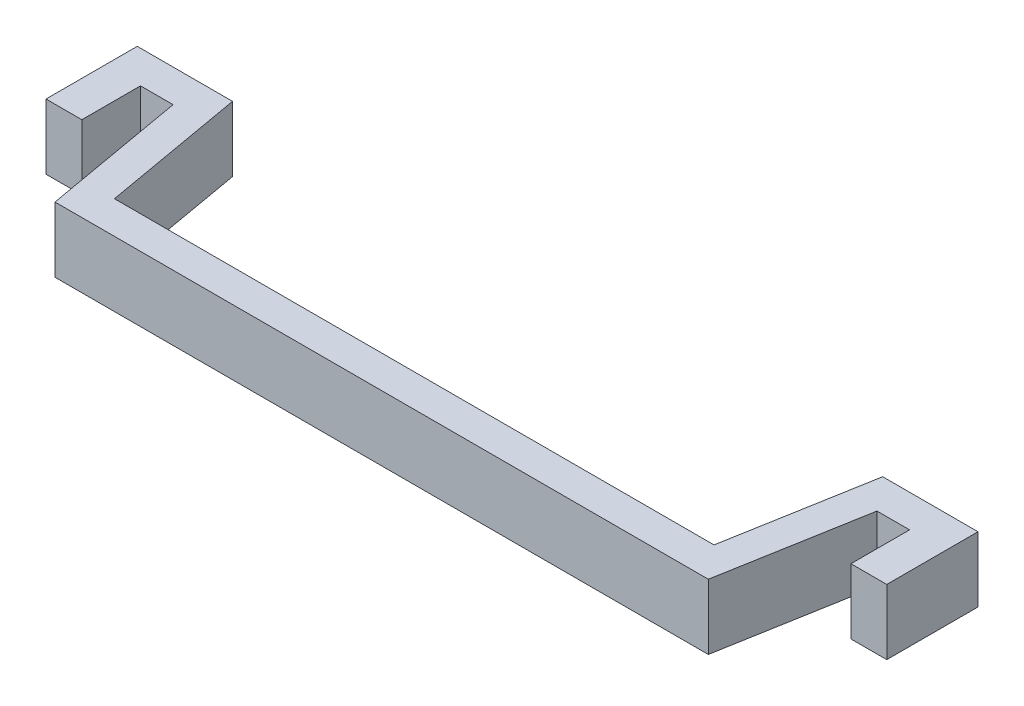
ISO-10303-21;
HEADER;
FILE_DESCRIPTION(('STEP AP214'),'2;1');
FILE_NAME('part.step','',(''),(''),'','','');
FILE_SCHEMA(('AUTOMOTIVE_DESIGN { 1 0 10303 214 1 1 1 1 }'));
ENDSEC;
DATA;
#1=APPLICATION_CONTEXT('core data for automotive mechanical design processes');
#2=APPLICATION_PROTOCOL_DEFINITION('international standard','automotive_design',2000,#1);
#3=PRODUCT_CONTEXT('',#1,'mechanical');
#4=PRODUCT('Part','Part','',(#3));
#5=PRODUCT_RELATED_PRODUCT_CATEGORY('part','',(#4));
#6=PRODUCT_DEFINITION_FORMATION('','',#4);
#7=PRODUCT_DEFINITION_CONTEXT('part definition',#1,'design');
#8=PRODUCT_DEFINITION('design','',#6,#7);
#9=PRODUCT_DEFINITION_SHAPE('','',#8);
#10=(LENGTH_UNIT() NAMED_UNIT(*) SI_UNIT(.MILLI.,.METRE.));
#11=(NAMED_UNIT(*) PLANE_ANGLE_UNIT() SI_UNIT($,.RADIAN.));
#12=(NAMED_UNIT(*) SI_UNIT($,.STERADIAN.) SOLID_ANGLE_UNIT());
#13=UNCERTAINTY_MEASURE_WITH_UNIT(LENGTH_MEASURE(1.E-05),#10,'distance_accuracy_value','');
#14=(GEOMETRIC_REPRESENTATION_CONTEXT(3) GLOBAL_UNCERTAINTY_ASSIGNED_CONTEXT((#13)) GLOBAL_UNIT_ASSIGNED_CONTEXT((#10,
#11,#12)) REPRESENTATION_CONTEXT('',''));
#15=CARTESIAN_POINT('',(0.,0.,0.));
#16=DIRECTION('',(0.,0.,1.));
#17=DIRECTION('',(1.,0.,0.));
#18=AXIS2_PLACEMENT_3D('',#15,#16,#17);
#19=CARTESIAN_POINT('',(-12.7306848318011,2.54,0.));
#20=DIRECTION('',(0.984807753012209,0.,-0.173648177666927));
#21=DIRECTION('',(-0.173648177666927,0.,-0.984807753012209));
#22=AXIS2_PLACEMENT_3D('',#19,#20,#21);
#23=PLANE('',#22);
#24=DIRECTION('',(0.173648177666927,0.,0.984807753012209));
#25=VECTOR('',#24,1.);
#26=CARTESIAN_POINT('',(-12.7306848318011,0.,0.));
#27=LINE('',#26,#25);
#28=CARTESIAN_POINT('',(-13.716,0.,-5.588));
#29=VERTEX_POINT('',#28);
#30=CARTESIAN_POINT('',(-12.7306848318011,0.,0.));
#31=VERTEX_POINT('',#30);
#32=EDGE_CURVE('E177',#29,#31,#27,.T.);
#33=ORIENTED_EDGE('',*,*,#32,.T.);
#34=DIRECTION('',(0.,-1.,0.));
#35=VECTOR('',#34,1.);
#36=CARTESIAN_POINT('',(-12.7306848318011,2.54,0.));
#37=LINE('',#36,#35);
#38=CARTESIAN_POINT('',(-12.7306848318011,2.54,0.));
#39=VERTEX_POINT('',#38);
#40=EDGE_CURVE('E11',#39,#31,#37,.T.);
#41=ORIENTED_EDGE('',*,*,#40,.F.);
#42=DIRECTION('',(0.173648177666927,0.,0.984807753012209));
#43=VECTOR('',#42,1.);
#44=CARTESIAN_POINT('',(-12.7306848318011,2.54,0.));
#45=LINE('',#44,#43);
#46=CARTESIAN_POINT('',(-13.716,2.54,-5.588));
#47=VERTEX_POINT('',#46);
#48=EDGE_CURVE('E207',#47,#39,#45,.T.);
#49=ORIENTED_EDGE('',*,*,#48,.F.);
#50=DIRECTION('',(0.,-1.,0.));
#51=VECTOR('',#50,1.);
#52=CARTESIAN_POINT('',(-13.716,2.54,-5.588));
#53=LINE('',#52,#51);
#54=EDGE_CURVE('E173',#47,#29,#53,.T.);
#55=ORIENTED_EDGE('',*,*,#54,.T.);
#56=EDGE_LOOP('',(#33,#41,#49,#55));
#57=FACE_BOUND('',#56,.T.);
#58=ADVANCED_FACE('F33',(#57),#23,.F.);
#59=CARTESIAN_POINT('',(12.7306848318011,2.54,0.));
#60=DIRECTION('',(0.,0.,-1.));
#61=DIRECTION('',(-1.,0.,0.));
#62=AXIS2_PLACEMENT_3D('',#59,#60,#61);
#63=PLANE('',#62);
#64=DIRECTION('',(1.,0.,0.));
#65=VECTOR('',#64,1.);
#66=CARTESIAN_POINT('',(12.7306848318011,0.,0.));
#67=LINE('',#66,#65);
#68=CARTESIAN_POINT('',(12.7306848318011,0.,0.));
#69=VERTEX_POINT('',#68);
#70=EDGE_CURVE('E180',#31,#69,#67,.T.);
#71=ORIENTED_EDGE('',*,*,#70,.T.);
#72=DIRECTION('',(0.,-1.,0.));
#73=VECTOR('',#72,1.);
#74=CARTESIAN_POINT('',(12.7306848318011,2.54,0.));
#75=LINE('',#74,#73);
#76=CARTESIAN_POINT('',(12.7306848318011,2.54,0.));
#77=VERTEX_POINT('',#76);
#78=EDGE_CURVE('E41',#77,#69,#75,.T.);
#79=ORIENTED_EDGE('',*,*,#78,.F.);
#80=DIRECTION('',(1.,0.,0.));
#81=VECTOR('',#80,1.);
#82=CARTESIAN_POINT('',(12.7306848318011,2.54,0.));
#83=LINE('',#82,#81);
#84=EDGE_CURVE('E116',#39,#77,#83,.T.);
#85=ORIENTED_EDGE('',*,*,#84,.F.);
#86=ORIENTED_EDGE('',*,*,#40,.T.);
#87=EDGE_LOOP('',(#71,#79,#85,#86));
#88=FACE_BOUND('',#87,.T.);
#89=ADVANCED_FACE('F305',(#88),#63,.F.);
#90=CARTESIAN_POINT('',(12.7306848318011,2.54,0.));
#91=DIRECTION('',(-0.984807753012209,0.,-0.173648177666927));
#92=DIRECTION('',(-0.173648177666927,0.,0.984807753012209));
#93=AXIS2_PLACEMENT_3D('',#90,#91,#92);
#94=PLANE('',#93);
#95=DIRECTION('',(0.173648177666927,0.,-0.984807753012209));
#96=VECTOR('',#95,1.);
#97=CARTESIAN_POINT('',(12.7306848318011,0.,0.));
#98=LINE('',#97,#96);
#99=CARTESIAN_POINT('',(13.716,0.,-5.588));
#100=VERTEX_POINT('',#99);
#101=EDGE_CURVE('E182',#69,#100,#98,.T.);
#102=ORIENTED_EDGE('',*,*,#101,.T.);
#103=DIRECTION('',(0.,-1.,0.));
#104=VECTOR('',#103,1.);
#105=CARTESIAN_POINT('',(13.716,2.54,-5.588));
#106=LINE('',#105,#104);
#107=CARTESIAN_POINT('',(13.716,2.54,-5.588));
#108=VERTEX_POINT('',#107);
#109=EDGE_CURVE('E238',#108,#100,#106,.T.);
#110=ORIENTED_EDGE('',*,*,#109,.F.);
#111=DIRECTION('',(0.173648177666927,0.,-0.984807753012209));
#112=VECTOR('',#111,1.);
#113=CARTESIAN_POINT('',(12.7306848318011,2.54,0.));
#114=LINE('',#113,#112);
#115=EDGE_CURVE('E246',#77,#108,#114,.T.);
#116=ORIENTED_EDGE('',*,*,#115,.F.);
#117=ORIENTED_EDGE('',*,*,#78,.T.);
#118=EDGE_LOOP('',(#102,#110,#116,#117));
#119=FACE_BOUND('',#118,.T.);
#120=ADVANCED_FACE('F244',(#119),#94,.F.);
#121=CARTESIAN_POINT('',(13.716,2.54,-5.588));
#122=DIRECTION('',(0.,0.,-1.));
#123=DIRECTION('',(-1.,0.,0.));
#124=AXIS2_PLACEMENT_3D('',#121,#122,#123);
#125=PLANE('',#124);
#126=DIRECTION('',(1.,0.,0.));
#127=VECTOR('',#126,1.);
#128=CARTESIAN_POINT('',(13.716,0.,-5.588));
#129=LINE('',#128,#127);
#130=CARTESIAN_POINT('',(14.986,0.,-5.588));
#131=VERTEX_POINT('',#130);
#132=EDGE_CURVE('E184',#100,#131,#129,.T.);
#133=ORIENTED_EDGE('',*,*,#132,.T.);
#134=DIRECTION('',(0.,-1.,0.));
#135=VECTOR('',#134,1.);
#136=CARTESIAN_POINT('',(14.986,2.54,-5.588));
#137=LINE('',#136,#135);
#138=CARTESIAN_POINT('',(14.986,2.54,-5.588));
#139=VERTEX_POINT('',#138);
#140=EDGE_CURVE('E235',#139,#131,#137,.T.);
#141=ORIENTED_EDGE('',*,*,#140,.F.);
#142=DIRECTION('',(1.,0.,0.));
#143=VECTOR('',#142,1.);
#144=CARTESIAN_POINT('',(13.716,2.54,-5.588));
#145=LINE('',#144,#143);
#146=EDGE_CURVE('E264',#108,#139,#145,.T.);
#147=ORIENTED_EDGE('',*,*,#146,.F.);
#148=ORIENTED_EDGE('',*,*,#109,.T.);
#149=EDGE_LOOP('',(#133,#141,#147,#148));
#150=FACE_BOUND('',#149,.T.);
#151=ADVANCED_FACE('F255',(#150),#125,.F.);
#152=CARTESIAN_POINT('',(14.986,2.54,-5.588));
#153=DIRECTION('',(1.,0.,0.));
#154=DIRECTION('',(0.,0.,-1.));
#155=AXIS2_PLACEMENT_3D('',#152,#153,#154);
#156=PLANE('',#155);
#157=DIRECTION('',(0.,0.,1.));
#158=VECTOR('',#157,1.);
#159=CARTESIAN_POINT('',(14.986,0.,-5.588));
#160=LINE('',#159,#158);
#161=CARTESIAN_POINT('',(14.986,0.,-3.302));
#162=VERTEX_POINT('',#161);
#163=EDGE_CURVE('E186',#131,#162,#160,.T.);
#164=ORIENTED_EDGE('',*,*,#163,.T.);
#165=DIRECTION('',(0.,-1.,0.));
#166=VECTOR('',#165,1.);
#167=CARTESIAN_POINT('',(14.986,2.54,-3.302));
#168=LINE('',#167,#166);
#169=CARTESIAN_POINT('',(14.986,2.54,-3.302));
#170=VERTEX_POINT('',#169);
#171=EDGE_CURVE('E232',#170,#162,#168,.T.);
#172=ORIENTED_EDGE('',*,*,#171,.F.);
#173=DIRECTION('',(0.,0.,1.));
#174=VECTOR('',#173,1.);
#175=CARTESIAN_POINT('',(14.986,2.54,-5.588));
#176=LINE('',#175,#174);
#177=EDGE_CURVE('E261',#139,#170,#176,.T.);
#178=ORIENTED_EDGE('',*,*,#177,.F.);
#179=ORIENTED_EDGE('',*,*,#140,.T.);
#180=EDGE_LOOP('',(#164,#172,#178,#179));
#181=FACE_BOUND('',#180,.T.);
#182=ADVANCED_FACE('F259',(#181),#156,.F.);
#183=CARTESIAN_POINT('',(14.986,2.54,-3.302));
#184=DIRECTION('',(0.,0.,-1.));
#185=DIRECTION('',(-1.,0.,0.));
#186=AXIS2_PLACEMENT_3D('',#183,#184,#185);
#187=PLANE('',#186);
#188=DIRECTION('',(1.,0.,0.));
#189=VECTOR('',#188,1.);
#190=CARTESIAN_POINT('',(14.986,0.,-3.302));
#191=LINE('',#190,#189);
#192=CARTESIAN_POINT('',(16.383,0.,-3.302));
#193=VERTEX_POINT('',#192);
#194=EDGE_CURVE('E188',#162,#193,#191,.T.);
#195=ORIENTED_EDGE('',*,*,#194,.T.);
#196=DIRECTION('',(0.,-1.,0.));
#197=VECTOR('',#196,1.);
#198=CARTESIAN_POINT('',(16.383,2.54,-3.302));
#199=LINE('',#198,#197);
#200=CARTESIAN_POINT('',(16.383,2.54,-3.302));
#201=VERTEX_POINT('',#200);
#202=EDGE_CURVE('E229',#201,#193,#199,.T.);
#203=ORIENTED_EDGE('',*,*,#202,.F.);
#204=DIRECTION('',(1.,0.,0.));
#205=VECTOR('',#204,1.);
#206=CARTESIAN_POINT('',(14.986,2.54,-3.302));
#207=LINE('',#206,#205);
#208=EDGE_CURVE('E263',#170,#201,#207,.T.);
#209=ORIENTED_EDGE('',*,*,#208,.F.);
#210=ORIENTED_EDGE('',*,*,#171,.T.);
#211=EDGE_LOOP('',(#195,#203,#209,#210));
#212=FACE_BOUND('',#211,.T.);
#213=ADVANCED_FACE('F318',(#212),#187,.F.);
#214=CARTESIAN_POINT('',(16.383,2.54,-3.302));
#215=DIRECTION('',(-1.,0.,0.));
#216=DIRECTION('',(0.,0.,1.));
#217=AXIS2_PLACEMENT_3D('',#214,#215,#216);
#218=PLANE('',#217);
#219=DIRECTION('',(0.,0.,-1.));
#220=VECTOR('',#219,1.);
#221=CARTESIAN_POINT('',(16.383,0.,-3.302));
#222=LINE('',#221,#220);
#223=CARTESIAN_POINT('',(16.383,0.,-6.858));
#224=VERTEX_POINT('',#223);
#225=EDGE_CURVE('E190',#193,#224,#222,.T.);
#226=ORIENTED_EDGE('',*,*,#225,.T.);
#227=DIRECTION('',(0.,-1.,0.));
#228=VECTOR('',#227,1.);
#229=CARTESIAN_POINT('',(16.383,2.54,-6.858));
#230=LINE('',#229,#228);
#231=CARTESIAN_POINT('',(16.383,2.54,-6.858));
#232=VERTEX_POINT('',#231);
#233=EDGE_CURVE('E226',#232,#224,#230,.T.);
#234=ORIENTED_EDGE('',*,*,#233,.F.);
#235=DIRECTION('',(0.,0.,-1.));
#236=VECTOR('',#235,1.);
#237=CARTESIAN_POINT('',(16.383,2.54,-3.302));
#238=LINE('',#237,#236);
#239=EDGE_CURVE('E266',#201,#232,#238,.T.);
#240=ORIENTED_EDGE('',*,*,#239,.F.);
#241=ORIENTED_EDGE('',*,*,#202,.T.);
#242=EDGE_LOOP('',(#226,#234,#240,#241));
#243=FACE_BOUND('',#242,.T.);
#244=ADVANCED_FACE('F321',(#243),#218,.F.);
#245=CARTESIAN_POINT('',(16.383,2.54,-6.858));
#246=DIRECTION('',(0.,0.,1.));
#247=DIRECTION('',(1.,0.,0.));
#248=AXIS2_PLACEMENT_3D('',#245,#246,#247);
#249=PLANE('',#248);
#250=DIRECTION('',(-1.,0.,0.));
#251=VECTOR('',#250,1.);
#252=CARTESIAN_POINT('',(16.383,0.,-6.858));
#253=LINE('',#252,#251);
#254=CARTESIAN_POINT('',(12.6693151681989,0.,-6.858));
#255=VERTEX_POINT('',#254);
#256=EDGE_CURVE('E192',#224,#255,#253,.T.);
#257=ORIENTED_EDGE('',*,*,#256,.T.);
#258=DIRECTION('',(0.,-1.,0.));
#259=VECTOR('',#258,1.);
#260=CARTESIAN_POINT('',(12.6693151681989,2.54,-6.858));
#261=LINE('',#260,#259);
#262=CARTESIAN_POINT('',(12.6693151681989,2.54,-6.858));
#263=VERTEX_POINT('',#262);
#264=EDGE_CURVE('E223',#263,#255,#261,.T.);
#265=ORIENTED_EDGE('',*,*,#264,.F.);
#266=DIRECTION('',(-1.,0.,0.));
#267=VECTOR('',#266,1.);
#268=CARTESIAN_POINT('',(16.383,2.54,-6.858));
#269=LINE('',#268,#267);
#270=EDGE_CURVE('E272',#232,#263,#269,.T.);
#271=ORIENTED_EDGE('',*,*,#270,.F.);
#272=ORIENTED_EDGE('',*,*,#233,.T.);
#273=EDGE_LOOP('',(#257,#265,#271,#272));
#274=FACE_BOUND('',#273,.T.);
#275=ADVANCED_FACE('F325',(#274),#249,.F.);
#276=CARTESIAN_POINT('',(12.6693151681989,2.54,-6.858));
#277=DIRECTION('',(0.984807753012209,0.,0.173648177666927));
#278=DIRECTION('',(0.173648177666927,0.,-0.984807753012209));
#279=AXIS2_PLACEMENT_3D('',#276,#277,#278);
#280=PLANE('',#279);
#281=DIRECTION('',(-0.173648177666927,0.,0.984807753012209));
#282=VECTOR('',#281,1.);
#283=CARTESIAN_POINT('',(12.6693151681989,0.,-6.858));
#284=LINE('',#283,#282);
#285=CARTESIAN_POINT('',(11.684,0.,-1.27));
#286=VERTEX_POINT('',#285);
#287=EDGE_CURVE('E194',#255,#286,#284,.T.);
#288=ORIENTED_EDGE('',*,*,#287,.T.);
#289=DIRECTION('',(0.,-1.,0.));
#290=VECTOR('',#289,1.);
#291=CARTESIAN_POINT('',(11.684,2.54,-1.27));
#292=LINE('',#291,#290);
#293=CARTESIAN_POINT('',(11.684,2.54,-1.27));
#294=VERTEX_POINT('',#293);
#295=EDGE_CURVE('E220',#294,#286,#292,.T.);
#296=ORIENTED_EDGE('',*,*,#295,.F.);
#297=DIRECTION('',(-0.173648177666927,0.,0.984807753012209));
#298=VECTOR('',#297,1.);
#299=CARTESIAN_POINT('',(12.6693151681989,2.54,-6.858));
#300=LINE('',#299,#298);
#301=EDGE_CURVE('E274',#263,#294,#300,.T.);
#302=ORIENTED_EDGE('',*,*,#301,.F.);
#303=ORIENTED_EDGE('',*,*,#264,.T.);
#304=EDGE_LOOP('',(#288,#296,#302,#303));
#305=FACE_BOUND('',#304,.T.);
#306=ADVANCED_FACE('F329',(#305),#280,.F.);
#307=CARTESIAN_POINT('',(-11.684,2.54,-1.27));
#308=DIRECTION('',(0.,0.,1.));
#309=DIRECTION('',(1.,0.,0.));
#310=AXIS2_PLACEMENT_3D('',#307,#308,#309);
#311=PLANE('',#310);
#312=DIRECTION('',(-1.,0.,0.));
#313=VECTOR('',#312,1.);
#314=CARTESIAN_POINT('',(-11.684,0.,-1.27));
#315=LINE('',#314,#313);
#316=CARTESIAN_POINT('',(-11.684,0.,-1.27));
#317=VERTEX_POINT('',#316);
#318=EDGE_CURVE('E196',#286,#317,#315,.T.);
#319=ORIENTED_EDGE('',*,*,#318,.T.);
#320=DIRECTION('',(0.,-1.,0.));
#321=VECTOR('',#320,1.);
#322=CARTESIAN_POINT('',(-11.684,2.54,-1.27));
#323=LINE('',#322,#321);
#324=CARTESIAN_POINT('',(-11.684,2.54,-1.27));
#325=VERTEX_POINT('',#324);
#326=EDGE_CURVE('E217',#325,#317,#323,.T.);
#327=ORIENTED_EDGE('',*,*,#326,.F.);
#328=DIRECTION('',(-1.,0.,0.));
#329=VECTOR('',#328,1.);
#330=CARTESIAN_POINT('',(-11.684,2.54,-1.27));
#331=LINE('',#330,#329);
#332=EDGE_CURVE('E276',#294,#325,#331,.T.);
#333=ORIENTED_EDGE('',*,*,#332,.F.);
#334=ORIENTED_EDGE('',*,*,#295,.T.);
#335=EDGE_LOOP('',(#319,#327,#333,#334));
#336=FACE_BOUND('',#335,.T.);
#337=ADVANCED_FACE('F333',(#336),#311,.F.);
#338=CARTESIAN_POINT('',(-12.6693151681989,2.54,-6.858));
#339=DIRECTION('',(-0.984807753012209,0.,0.173648177666927));
#340=DIRECTION('',(0.173648177666927,0.,0.984807753012209));
#341=AXIS2_PLACEMENT_3D('',#338,#339,#340);
#342=PLANE('',#341);
#343=DIRECTION('',(-0.173648177666927,0.,-0.984807753012209));
#344=VECTOR('',#343,1.);
#345=CARTESIAN_POINT('',(-12.6693151681989,0.,-6.858));
#346=LINE('',#345,#344);
#347=CARTESIAN_POINT('',(-12.6693151681989,0.,-6.858));
#348=VERTEX_POINT('',#347);
#349=EDGE_CURVE('E198',#317,#348,#346,.T.);
#350=ORIENTED_EDGE('',*,*,#349,.T.);
#351=DIRECTION('',(0.,-1.,0.));
#352=VECTOR('',#351,1.);
#353=CARTESIAN_POINT('',(-12.6693151681989,2.54,-6.858));
#354=LINE('',#353,#352);
#355=CARTESIAN_POINT('',(-12.6693151681989,2.54,-6.858));
#356=VERTEX_POINT('',#355);
#357=EDGE_CURVE('E214',#356,#348,#354,.T.);
#358=ORIENTED_EDGE('',*,*,#357,.F.);
#359=DIRECTION('',(-0.173648177666927,0.,-0.984807753012209));
#360=VECTOR('',#359,1.);
#361=CARTESIAN_POINT('',(-12.6693151681989,2.54,-6.858));
#362=LINE('',#361,#360);
#363=EDGE_CURVE('E278',#325,#356,#362,.T.);
#364=ORIENTED_EDGE('',*,*,#363,.F.);
#365=ORIENTED_EDGE('',*,*,#326,.T.);
#366=EDGE_LOOP('',(#350,#358,#364,#365));
#367=FACE_BOUND('',#366,.T.);
#368=ADVANCED_FACE('F337',(#367),#342,.F.);
#369=CARTESIAN_POINT('',(-16.383,2.54,-6.858));
#370=DIRECTION('',(0.,0.,1.));
#371=DIRECTION('',(1.,0.,0.));
#372=AXIS2_PLACEMENT_3D('',#369,#370,#371);
#373=PLANE('',#372);
#374=DIRECTION('',(-1.,0.,0.));
#375=VECTOR('',#374,1.);
#376=CARTESIAN_POINT('',(-16.383,0.,-6.858));
#377=LINE('',#376,#375);
#378=CARTESIAN_POINT('',(-16.383,0.,-6.858));
#379=VERTEX_POINT('',#378);
#380=EDGE_CURVE('E200',#348,#379,#377,.T.);
#381=ORIENTED_EDGE('',*,*,#380,.T.);
#382=DIRECTION('',(0.,-1.,0.));
#383=VECTOR('',#382,1.);
#384=CARTESIAN_POINT('',(-16.383,2.54,-6.858));
#385=LINE('',#384,#383);
#386=CARTESIAN_POINT('',(-16.383,2.54,-6.858));
#387=VERTEX_POINT('',#386);
#388=EDGE_CURVE('E211',#387,#379,#385,.T.);
#389=ORIENTED_EDGE('',*,*,#388,.F.);
#390=DIRECTION('',(-1.,0.,0.));
#391=VECTOR('',#390,1.);
#392=CARTESIAN_POINT('',(-16.383,2.54,-6.858));
#393=LINE('',#392,#391);
#394=EDGE_CURVE('E280',#356,#387,#393,.T.);
#395=ORIENTED_EDGE('',*,*,#394,.F.);
#396=ORIENTED_EDGE('',*,*,#357,.T.);
#397=EDGE_LOOP('',(#381,#389,#395,#396));
#398=FACE_BOUND('',#397,.T.);
#399=ADVANCED_FACE('F286',(#398),#373,.F.);
#400=CARTESIAN_POINT('',(-16.383,2.54,-3.302));
#401=DIRECTION('',(1.,0.,0.));
#402=DIRECTION('',(0.,0.,-1.));
#403=AXIS2_PLACEMENT_3D('',#400,#401,#402);
#404=PLANE('',#403);
#405=DIRECTION('',(0.,0.,1.));
#406=VECTOR('',#405,1.);
#407=CARTESIAN_POINT('',(-16.383,0.,-3.302));
#408=LINE('',#407,#406);
#409=CARTESIAN_POINT('',(-16.383,0.,-3.302));
#410=VERTEX_POINT('',#409);
#411=EDGE_CURVE('E202',#379,#410,#408,.T.);
#412=ORIENTED_EDGE('',*,*,#411,.T.);
#413=DIRECTION('',(0.,-1.,0.));
#414=VECTOR('',#413,1.);
#415=CARTESIAN_POINT('',(-16.383,2.54,-3.302));
#416=LINE('',#415,#414);
#417=CARTESIAN_POINT('',(-16.383,2.54,-3.302));
#418=VERTEX_POINT('',#417);
#419=EDGE_CURVE('E168',#418,#410,#416,.T.);
#420=ORIENTED_EDGE('',*,*,#419,.F.);
#421=DIRECTION('',(0.,0.,1.));
#422=VECTOR('',#421,1.);
#423=CARTESIAN_POINT('',(-16.383,2.54,-3.302));
#424=LINE('',#423,#422);
#425=EDGE_CURVE('E159',#387,#418,#424,.T.);
#426=ORIENTED_EDGE('',*,*,#425,.F.);
#427=ORIENTED_EDGE('',*,*,#388,.T.);
#428=EDGE_LOOP('',(#412,#420,#426,#427));
#429=FACE_BOUND('',#428,.T.);
#430=ADVANCED_FACE('F290',(#429),#404,.F.);
#431=CARTESIAN_POINT('',(-14.986,2.54,-3.302));
#432=DIRECTION('',(0.,0.,-1.));
#433=DIRECTION('',(-1.,0.,0.));
#434=AXIS2_PLACEMENT_3D('',#431,#432,#433);
#435=PLANE('',#434);
#436=DIRECTION('',(1.,0.,0.));
#437=VECTOR('',#436,1.);
#438=CARTESIAN_POINT('',(-14.986,0.,-3.302));
#439=LINE('',#438,#437);
#440=CARTESIAN_POINT('',(-14.986,0.,-3.302));
#441=VERTEX_POINT('',#440);
#442=EDGE_CURVE('E167',#410,#441,#439,.T.);
#443=ORIENTED_EDGE('',*,*,#442,.T.);
#444=DIRECTION('',(0.,-1.,0.));
#445=VECTOR('',#444,1.);
#446=CARTESIAN_POINT('',(-14.986,2.54,-3.302));
#447=LINE('',#446,#445);
#448=CARTESIAN_POINT('',(-14.986,2.54,-3.302));
#449=VERTEX_POINT('',#448);
#450=EDGE_CURVE('E164',#449,#441,#447,.T.);
#451=ORIENTED_EDGE('',*,*,#450,.F.);
#452=DIRECTION('',(1.,0.,0.));
#453=VECTOR('',#452,1.);
#454=CARTESIAN_POINT('',(-14.986,2.54,-3.302));
#455=LINE('',#454,#453);
#456=EDGE_CURVE('E153',#418,#449,#455,.T.);
#457=ORIENTED_EDGE('',*,*,#456,.F.);
#458=ORIENTED_EDGE('',*,*,#419,.T.);
#459=EDGE_LOOP('',(#443,#451,#457,#458));
#460=FACE_BOUND('',#459,.T.);
#461=ADVANCED_FACE('F165',(#460),#435,.F.);
#462=CARTESIAN_POINT('',(-14.986,2.54,-5.588));
#463=DIRECTION('',(-1.,0.,0.));
#464=DIRECTION('',(0.,0.,1.));
#465=AXIS2_PLACEMENT_3D('',#462,#463,#464);
#466=PLANE('',#465);
#467=DIRECTION('',(0.,0.,-1.));
#468=VECTOR('',#467,1.);
#469=CARTESIAN_POINT('',(-14.986,0.,-5.588));
#470=LINE('',#469,#468);
#471=CARTESIAN_POINT('',(-14.986,0.,-5.588));
#472=VERTEX_POINT('',#471);
#473=EDGE_CURVE('E102',#441,#472,#470,.T.);
#474=ORIENTED_EDGE('',*,*,#473,.T.);
#475=DIRECTION('',(0.,-1.,0.));
#476=VECTOR('',#475,1.);
#477=CARTESIAN_POINT('',(-14.986,2.54,-5.588));
#478=LINE('',#477,#476);
#479=CARTESIAN_POINT('',(-14.986,2.54,-5.588));
#480=VERTEX_POINT('',#479);
#481=EDGE_CURVE('E169',#480,#472,#478,.T.);
#482=ORIENTED_EDGE('',*,*,#481,.F.);
#483=DIRECTION('',(0.,0.,-1.));
#484=VECTOR('',#483,1.);
#485=CARTESIAN_POINT('',(-14.986,2.54,-5.588));
#486=LINE('',#485,#484);
#487=EDGE_CURVE('E157',#449,#480,#486,.T.);
#488=ORIENTED_EDGE('',*,*,#487,.F.);
#489=ORIENTED_EDGE('',*,*,#450,.T.);
#490=EDGE_LOOP('',(#474,#482,#488,#489));
#491=FACE_BOUND('',#490,.T.);
#492=ADVANCED_FACE('F171',(#491),#466,.F.);
#493=CARTESIAN_POINT('',(-13.716,2.54,-5.588));
#494=DIRECTION('',(0.,0.,-1.));
#495=DIRECTION('',(-1.,0.,0.));
#496=AXIS2_PLACEMENT_3D('',#493,#494,#495);
#497=PLANE('',#496);
#498=DIRECTION('',(1.,0.,0.));
#499=VECTOR('',#498,1.);
#500=CARTESIAN_POINT('',(-13.716,0.,-5.588));
#501=LINE('',#500,#499);
#502=EDGE_CURVE('E108',#472,#29,#501,.T.);
#503=ORIENTED_EDGE('',*,*,#502,.T.);
#504=ORIENTED_EDGE('',*,*,#54,.F.);
#505=DIRECTION('',(1.,0.,0.));
#506=VECTOR('',#505,1.);
#507=CARTESIAN_POINT('',(-13.716,2.54,-5.588));
#508=LINE('',#507,#506);
#509=EDGE_CURVE('E49',#480,#47,#508,.T.);
#510=ORIENTED_EDGE('',*,*,#509,.F.);
#511=ORIENTED_EDGE('',*,*,#481,.T.);
#512=EDGE_LOOP('',(#503,#504,#510,#511));
#513=FACE_BOUND('',#512,.T.);
#514=ADVANCED_FACE('F294',(#513),#497,.F.);
#515=CARTESIAN_POINT('',(0.,2.54,0.));
#516=DIRECTION('',(0.,1.,0.));
#517=DIRECTION('',(0.,0.,1.));
#518=AXIS2_PLACEMENT_3D('',#515,#516,#517);
#519=PLANE('',#518);
#520=ORIENTED_EDGE('',*,*,#48,.T.);
#521=ORIENTED_EDGE('',*,*,#84,.T.);
#522=ORIENTED_EDGE('',*,*,#115,.T.);
#523=ORIENTED_EDGE('',*,*,#146,.T.);
#524=ORIENTED_EDGE('',*,*,#177,.T.);
#525=ORIENTED_EDGE('',*,*,#208,.T.);
#526=ORIENTED_EDGE('',*,*,#239,.T.);
#527=ORIENTED_EDGE('',*,*,#270,.T.);
#528=ORIENTED_EDGE('',*,*,#301,.T.);
#529=ORIENTED_EDGE('',*,*,#332,.T.);
#530=ORIENTED_EDGE('',*,*,#363,.T.);
#531=ORIENTED_EDGE('',*,*,#394,.T.);
#532=ORIENTED_EDGE('',*,*,#425,.T.);
#533=ORIENTED_EDGE('',*,*,#456,.T.);
#534=ORIENTED_EDGE('',*,*,#487,.T.);
#535=ORIENTED_EDGE('',*,*,#509,.T.);
#536=EDGE_LOOP('',(#520,#521,#522,#523,#524,#525,#526,#527,#528,#529,#530,#531,#532,#533,#534,#535));
#537=FACE_BOUND('',#536,.T.);
#538=ADVANCED_FACE('F155',(#537),#519,.T.);
#539=CARTESIAN_POINT('',(0.,0.,0.));
#540=DIRECTION('',(0.,1.,0.));
#541=DIRECTION('',(0.,0.,1.));
#542=AXIS2_PLACEMENT_3D('',#539,#540,#541);
#543=PLANE('',#542);
#544=ORIENTED_EDGE('',*,*,#32,.F.);
#545=ORIENTED_EDGE('',*,*,#502,.F.);
#546=ORIENTED_EDGE('',*,*,#473,.F.);
#547=ORIENTED_EDGE('',*,*,#442,.F.);
#548=ORIENTED_EDGE('',*,*,#411,.F.);
#549=ORIENTED_EDGE('',*,*,#380,.F.);
#550=ORIENTED_EDGE('',*,*,#349,.F.);
#551=ORIENTED_EDGE('',*,*,#318,.F.);
#552=ORIENTED_EDGE('',*,*,#287,.F.);
#553=ORIENTED_EDGE('',*,*,#256,.F.);
#554=ORIENTED_EDGE('',*,*,#225,.F.);
#555=ORIENTED_EDGE('',*,*,#194,.F.);
#556=ORIENTED_EDGE('',*,*,#163,.F.);
#557=ORIENTED_EDGE('',*,*,#132,.F.);
#558=ORIENTED_EDGE('',*,*,#101,.F.);
#559=ORIENTED_EDGE('',*,*,#70,.F.);
#560=EDGE_LOOP('',(#544,#545,#546,#547,#548,#549,#550,#551,#552,#553,#554,#555,#556,#557,#558,#559));
#561=FACE_BOUND('',#560,.T.);
#562=ADVANCED_FACE('F250',(#561),#543,.F.);
#563=CLOSED_SHELL('',(#58,#89,#120,#151,#182,#213,#244,#275,#306,#337,#368,#399,#430,#461,#492,
#514,#538,#562));
#564=MANIFOLD_SOLID_BREP('B2',#563);
#565=ADVANCED_BREP_SHAPE_REPRESENTATION('',(#18,#564),#14);
#566=SHAPE_DEFINITION_REPRESENTATION(#9,#565);
ENDSEC;
END-ISO-10303-21;
